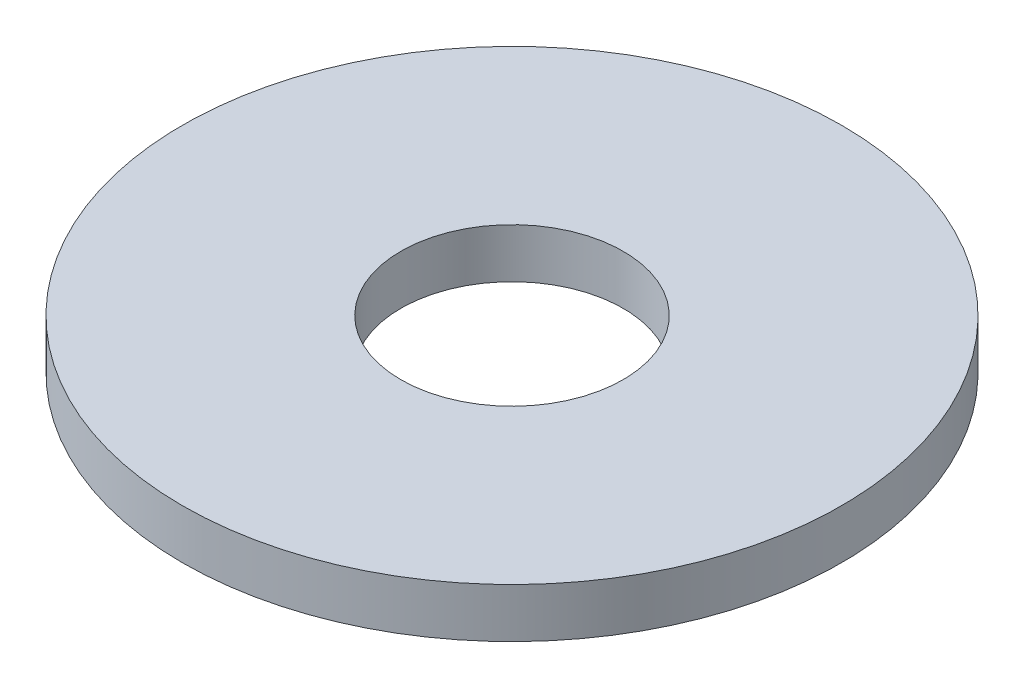
ISO-10303-21;
HEADER;
FILE_DESCRIPTION(('STEP AP214'),'2;1');
FILE_NAME('part.step','',(''),(''),'','','');
FILE_SCHEMA(('AUTOMOTIVE_DESIGN { 1 0 10303 214 1 1 1 1 }'));
ENDSEC;
DATA;
#1=APPLICATION_CONTEXT('core data for automotive mechanical design processes');
#2=APPLICATION_PROTOCOL_DEFINITION('international standard','automotive_design',2000,#1);
#3=PRODUCT_CONTEXT('',#1,'mechanical');
#4=PRODUCT('Part','Part','',(#3));
#5=PRODUCT_RELATED_PRODUCT_CATEGORY('part','',(#4));
#6=PRODUCT_DEFINITION_FORMATION('','',#4);
#7=PRODUCT_DEFINITION_CONTEXT('part definition',#1,'design');
#8=PRODUCT_DEFINITION('design','',#6,#7);
#9=PRODUCT_DEFINITION_SHAPE('','',#8);
#10=(LENGTH_UNIT() NAMED_UNIT(*) SI_UNIT(.MILLI.,.METRE.));
#11=(NAMED_UNIT(*) PLANE_ANGLE_UNIT() SI_UNIT($,.RADIAN.));
#12=(NAMED_UNIT(*) SI_UNIT($,.STERADIAN.) SOLID_ANGLE_UNIT());
#13=UNCERTAINTY_MEASURE_WITH_UNIT(LENGTH_MEASURE(1.E-05),#10,'distance_accuracy_value','');
#14=(GEOMETRIC_REPRESENTATION_CONTEXT(3) GLOBAL_UNCERTAINTY_ASSIGNED_CONTEXT((#13)) GLOBAL_UNIT_ASSIGNED_CONTEXT((#10,
#11,#12)) REPRESENTATION_CONTEXT('',''));
#15=CARTESIAN_POINT('',(0.,0.,0.));
#16=DIRECTION('',(0.,0.,1.));
#17=DIRECTION('',(1.,0.,0.));
#18=AXIS2_PLACEMENT_3D('',#15,#16,#17);
#19=CARTESIAN_POINT('',(0.,6.00000000000001,0.));
#20=DIRECTION('',(0.,1.,0.));
#21=DIRECTION('',(0.,0.,1.00000000000001));
#22=AXIS2_PLACEMENT_3D('',#19,#20,#21);
#23=PLANE('',#22);
#24=CARTESIAN_POINT('',(0.,6.00000000000001,0.));
#25=DIRECTION('',(0.,1.,0.));
#26=DIRECTION('',(0.,0.,1.00000000000001));
#27=AXIS2_PLACEMENT_3D('',#24,#25,#26);
#28=CIRCLE('',#27,40.);
#29=CARTESIAN_POINT('',(0.,6.00000000000001,40.0000000000003));
#30=VERTEX_POINT('',#29);
#31=EDGE_CURVE('E10',#30,#30,#28,.T.);
#32=ORIENTED_EDGE('',*,*,#31,.T.);
#33=EDGE_LOOP('',(#32));
#34=FACE_BOUND('',#33,.T.);
#35=CARTESIAN_POINT('',(0.,6.00000000000001,0.));
#36=DIRECTION('',(0.,1.,0.));
#37=DIRECTION('',(0.,0.,1.00000000000001));
#38=AXIS2_PLACEMENT_3D('',#35,#36,#37);
#39=CIRCLE('',#38,13.5);
#40=CARTESIAN_POINT('',(0.,6.00000000000001,13.5000000000001));
#41=VERTEX_POINT('',#40);
#42=EDGE_CURVE('E43',#41,#41,#39,.T.);
#43=ORIENTED_EDGE('',*,*,#42,.F.);
#44=EDGE_LOOP('',(#43));
#45=FACE_BOUND('',#44,.T.);
#46=ADVANCED_FACE('F32',(#34,#45),#23,.T.);
#47=CARTESIAN_POINT('',(0.,0.,0.));
#48=DIRECTION('',(0.,1.,0.));
#49=DIRECTION('',(0.,0.,1.00000000000001));
#50=AXIS2_PLACEMENT_3D('',#47,#48,#49);
#51=PLANE('',#50);
#52=CARTESIAN_POINT('',(0.,0.,0.));
#53=DIRECTION('',(0.,1.,0.));
#54=DIRECTION('',(0.,0.,1.00000000000001));
#55=AXIS2_PLACEMENT_3D('',#52,#53,#54);
#56=CIRCLE('',#55,40.);
#57=CARTESIAN_POINT('',(0.,0.,40.0000000000003));
#58=VERTEX_POINT('',#57);
#59=EDGE_CURVE('E36',#58,#58,#56,.T.);
#60=ORIENTED_EDGE('',*,*,#59,.F.);
#61=EDGE_LOOP('',(#60));
#62=FACE_BOUND('',#61,.T.);
#63=CARTESIAN_POINT('',(0.,0.,0.));
#64=DIRECTION('',(0.,1.,0.));
#65=DIRECTION('',(0.,0.,1.00000000000001));
#66=AXIS2_PLACEMENT_3D('',#63,#64,#65);
#67=CIRCLE('',#66,13.5);
#68=CARTESIAN_POINT('',(0.,0.,13.5000000000001));
#69=VERTEX_POINT('',#68);
#70=EDGE_CURVE('E45',#69,#69,#67,.T.);
#71=ORIENTED_EDGE('',*,*,#70,.T.);
#72=EDGE_LOOP('',(#71));
#73=FACE_BOUND('',#72,.T.);
#74=ADVANCED_FACE('F55',(#62,#73),#51,.F.);
#75=CARTESIAN_POINT('',(0.,6.00000000000001,0.));
#76=DIRECTION('',(0.,-1.,0.));
#77=DIRECTION('',(0.,0.,-1.00000000000001));
#78=AXIS2_PLACEMENT_3D('',#75,#76,#77);
#79=CYLINDRICAL_SURFACE('',#78,40.);
#80=ORIENTED_EDGE('',*,*,#31,.F.);
#81=EDGE_LOOP('',(#80));
#82=FACE_BOUND('',#81,.T.);
#83=ORIENTED_EDGE('',*,*,#59,.T.);
#84=EDGE_LOOP('',(#83));
#85=FACE_BOUND('',#84,.T.);
#86=ADVANCED_FACE('F34',(#82,#85),#79,.T.);
#87=CARTESIAN_POINT('',(0.,6.00000000000001,0.));
#88=DIRECTION('',(0.,-1.,0.));
#89=DIRECTION('',(0.,0.,-1.00000000000001));
#90=AXIS2_PLACEMENT_3D('',#87,#88,#89);
#91=CYLINDRICAL_SURFACE('',#90,13.5);
#92=ORIENTED_EDGE('',*,*,#42,.T.);
#93=EDGE_LOOP('',(#92));
#94=FACE_BOUND('',#93,.T.);
#95=ORIENTED_EDGE('',*,*,#70,.F.);
#96=EDGE_LOOP('',(#95));
#97=FACE_BOUND('',#96,.T.);
#98=ADVANCED_FACE('F51',(#94,#97),#91,.F.);
#99=CLOSED_SHELL('',(#46,#74,#86,#98));
#100=MANIFOLD_SOLID_BREP('B2',#99);
#101=ADVANCED_BREP_SHAPE_REPRESENTATION('',(#18,#100),#14);
#102=SHAPE_DEFINITION_REPRESENTATION(#9,#101);
ENDSEC;
END-ISO-10303-21;
